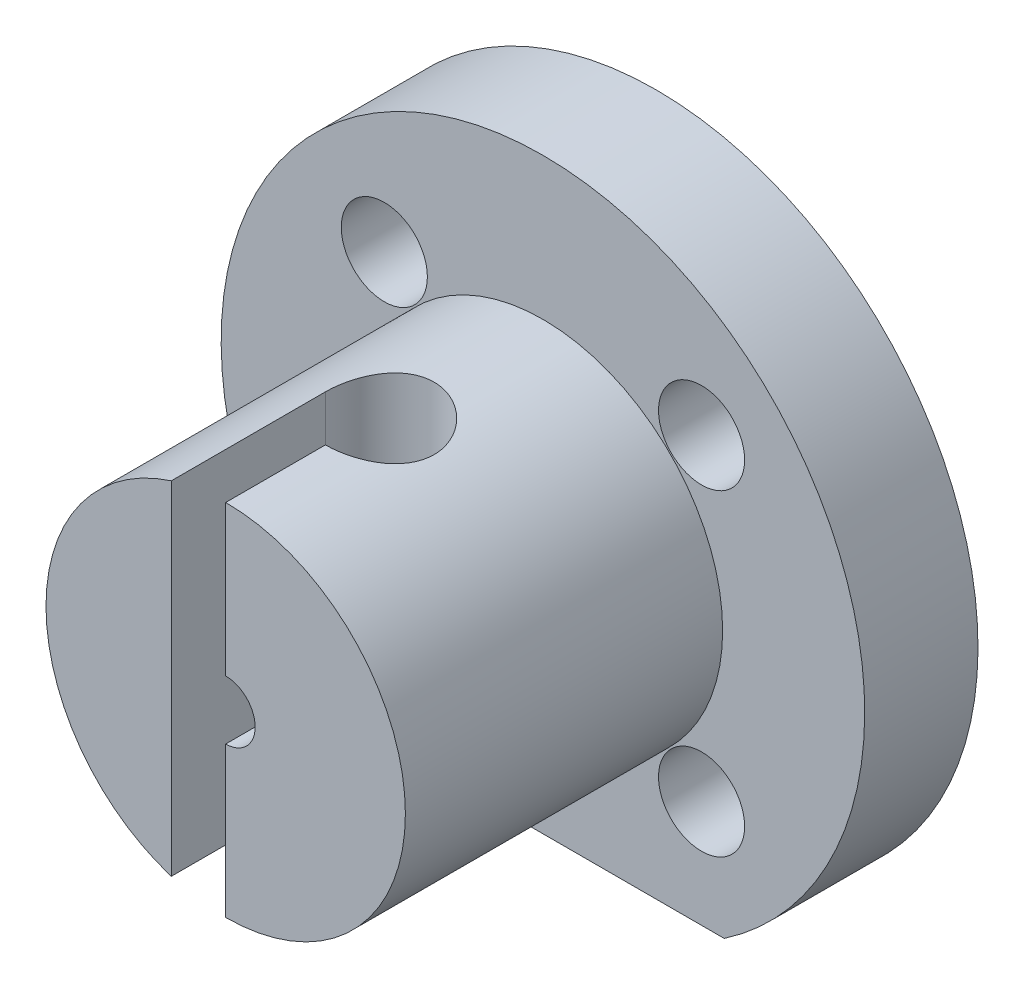
ISO-10303-21;
HEADER;
FILE_DESCRIPTION(('STEP AP214'),'2;1');
FILE_NAME('part.step','',(''),(''),'','','');
FILE_SCHEMA(('AUTOMOTIVE_DESIGN { 1 0 10303 214 1 1 1 1 }'));
ENDSEC;
DATA;
#1=APPLICATION_CONTEXT('core data for automotive mechanical design processes');
#2=APPLICATION_PROTOCOL_DEFINITION('international standard','automotive_design',2000,#1);
#3=PRODUCT_CONTEXT('',#1,'mechanical');
#4=PRODUCT('Part','Part','',(#3));
#5=PRODUCT_RELATED_PRODUCT_CATEGORY('part','',(#4));
#6=PRODUCT_DEFINITION_FORMATION('','',#4);
#7=PRODUCT_DEFINITION_CONTEXT('part definition',#1,'design');
#8=PRODUCT_DEFINITION('design','',#6,#7);
#9=PRODUCT_DEFINITION_SHAPE('','',#8);
#10=(LENGTH_UNIT() NAMED_UNIT(*) SI_UNIT(.MILLI.,.METRE.));
#11=(NAMED_UNIT(*) PLANE_ANGLE_UNIT() SI_UNIT($,.RADIAN.));
#12=(NAMED_UNIT(*) SI_UNIT($,.STERADIAN.) SOLID_ANGLE_UNIT());
#13=UNCERTAINTY_MEASURE_WITH_UNIT(LENGTH_MEASURE(1.E-05),#10,'distance_accuracy_value','');
#14=(GEOMETRIC_REPRESENTATION_CONTEXT(3) GLOBAL_UNCERTAINTY_ASSIGNED_CONTEXT((#13)) GLOBAL_UNIT_ASSIGNED_CONTEXT((#10,
#11,#12)) REPRESENTATION_CONTEXT('',''));
#15=CARTESIAN_POINT('',(0.,0.,0.));
#16=DIRECTION('',(0.,0.,1.));
#17=DIRECTION('',(1.,0.,0.));
#18=AXIS2_PLACEMENT_3D('',#15,#16,#17);
#19=CARTESIAN_POINT('',(0.,0.,5.));
#20=DIRECTION('',(0.,0.,-1.));
#21=DIRECTION('',(-1.,0.,0.));
#22=AXIS2_PLACEMENT_3D('',#19,#20,#21);
#23=CYLINDRICAL_SURFACE('',#22,3.25);
#24=CARTESIAN_POINT('',(-3.25,0.,17.956439749542));
#25=CARTESIAN_POINT('',(-3.24999996693236,0.083563896546241,17.9564398648353));
#26=CARTESIAN_POINT('',(-3.24677096676193,0.167123343293872,17.9543538266574));
#27=CARTESIAN_POINT('',(-3.23391734807946,0.333555171397627,17.9461076212372));
#28=CARTESIAN_POINT('',(-3.22429047825007,0.41642730049974,17.9399460198671));
#29=CARTESIAN_POINT('',(-3.18595574933086,0.663207682517021,17.9156447151389));
#30=CARTESIAN_POINT('',(-3.14779396870059,0.825188308617522,17.891688891228));
#31=CARTESIAN_POINT('',(-3.04855659613359,1.13828809180442,17.831870058011));
#32=CARTESIAN_POINT('',(-2.98762006951948,1.28946666599319,17.7960794630842));
#33=CARTESIAN_POINT('',(-2.84499499316467,1.57943583019607,17.7167568818193));
#34=CARTESIAN_POINT('',(-2.76330258081972,1.71822410791171,17.6732234550176));
#35=CARTESIAN_POINT('',(-2.57212901201941,1.99437802802984,17.5781364963853));
#36=CARTESIAN_POINT('',(-2.46071147687406,2.13027701426631,17.5262149891473));
#37=CARTESIAN_POINT('',(-2.21729460326256,2.38262218284384,17.4231624411781));
#38=CARTESIAN_POINT('',(-2.08528341307837,2.49905708310138,17.3720318743773));
#39=CARTESIAN_POINT('',(-1.79098374604103,2.71867691037722,17.2712659164381));
#40=CARTESIAN_POINT('',(-1.62709552363216,2.81997481240895,17.2221023183224));
#41=CARTESIAN_POINT('',(-1.36809931022023,2.9496044433443,17.1573730310798));
#42=CARTESIAN_POINT('',(-1.27953996702976,2.98910469424918,17.1372938410349));
#43=CARTESIAN_POINT('',(-1.09861795365718,3.06022294831571,17.1007180219324));
#44=CARTESIAN_POINT('',(-1.00625760269819,3.09184567731803,17.0842192457015));
#45=CARTESIAN_POINT('',(-0.826057560643886,3.14455413578487,17.0564941520974));
#46=CARTESIAN_POINT('',(-0.73845451489783,3.16628424100559,17.044949803767));
#47=CARTESIAN_POINT('',(-0.561380566299095,3.20242275220663,17.0256567176893));
#48=CARTESIAN_POINT('',(-0.47191065098631,3.21683493189189,17.0179060237062));
#49=CARTESIAN_POINT('',(-0.291850811820565,3.23813744872504,17.0064241227235));
#50=CARTESIAN_POINT('',(-0.201261326666201,3.245030643204,17.002691388844));
#51=CARTESIAN_POINT('',(-0.0197765201541427,3.25120998258422,16.9993445227305));
#52=CARTESIAN_POINT('',(0.0711187774662691,3.25049670487901,16.9997300778848));
#53=CARTESIAN_POINT('',(0.324584260634256,3.23784378778857,17.0065835083587));
#54=CARTESIAN_POINT('',(0.486706572337187,3.21743259044853,17.0176417439866));
#55=CARTESIAN_POINT('',(0.804703117396463,3.15298819811978,17.0520497508798));
#56=CARTESIAN_POINT('',(0.960576872565473,3.10895319895189,17.0754004609342));
#57=CARTESIAN_POINT('',(1.264141063125,2.99847124841088,17.132626287986));
#58=CARTESIAN_POINT('',(1.41171788658145,2.93177440550806,17.1666184036695));
#59=CARTESIAN_POINT('',(1.69387834199022,2.77832822842747,17.2422094341557));
#60=CARTESIAN_POINT('',(1.82845769113216,2.69157231631065,17.2838108433252));
#61=CARTESIAN_POINT('',(2.0960295127364,2.48999898771934,17.3760568864237));
#62=CARTESIAN_POINT('',(2.22734971450851,2.3731844420122,17.4271926057158));
#63=CARTESIAN_POINT('',(2.46950152361498,2.12009816423318,17.5301814135582));
#64=CARTESIAN_POINT('',(2.58031271060054,1.98380727668562,17.5820351624213));
#65=CARTESIAN_POINT('',(2.78756325494605,1.68172248261859,17.6854910122399));
#66=CARTESIAN_POINT('',(2.8820309516434,1.51441553141212,17.7367108317201));
#67=CARTESIAN_POINT('',(3.00108891492904,1.25110834412701,17.8042753830464));
#68=CARTESIAN_POINT('',(3.03700531506285,1.16126452825694,17.8252555906966));
#69=CARTESIAN_POINT('',(3.1008713993925,0.978003912550656,17.8632716996168));
#70=CARTESIAN_POINT('',(3.12882639782873,0.884589543522835,17.8803102305257));
#71=CARTESIAN_POINT('',(3.17442689107617,0.702564928746536,17.9084703141186));
#72=CARTESIAN_POINT('',(3.19272124708897,0.614173478503267,17.9199578250877));
#73=CARTESIAN_POINT('',(3.22192198879423,0.435756119777968,17.9384273052914));
#74=CARTESIAN_POINT('',(3.23283257877884,0.345731171441865,17.9454118383995));
#75=CARTESIAN_POINT('',(3.24707990238843,0.164890259562273,17.9545518135648));
#76=CARTESIAN_POINT('',(3.25042152893957,0.0740748451557672,17.9567103753403));
#77=CARTESIAN_POINT('',(3.24949268104905,-0.107470356168658,17.9561138418405));
#78=CARTESIAN_POINT('',(3.24522297157071,-0.198200150774714,17.9533592403536));
#79=CARTESIAN_POINT('',(3.22331821945136,-0.443814478138871,17.9393129833951));
#80=CARTESIAN_POINT('',(3.19827229148617,-0.597844457189913,17.9233018347216));
#81=CARTESIAN_POINT('',(3.12702949977269,-0.899004670695931,17.8791221190599));
#82=CARTESIAN_POINT('',(3.08082387501063,-1.04613201932351,17.850948516576));
#83=CARTESIAN_POINT('',(2.96661435840787,-1.33683554250898,17.7842795565511));
#84=CARTESIAN_POINT('',(2.89775284733054,-1.47998175133418,17.7453899190323));
#85=CARTESIAN_POINT('',(2.74089637902852,-1.75353567365312,17.6618939562451));
#86=CARTESIAN_POINT('',(2.652891801511,-1.88393693428162,17.6172847612743));
#87=CARTESIAN_POINT('',(2.44460624673826,-2.14918631391297,17.5192087176446));
#88=CARTESIAN_POINT('',(2.32144841107884,-2.28167102505445,17.4654297186389));
#89=CARTESIAN_POINT('',(2.05415168686647,-2.52500389576817,17.3607560791634));
#90=CARTESIAN_POINT('',(1.91000153159266,-2.63584036131697,17.3098630080996));
#91=CARTESIAN_POINT('',(1.59623133690324,-2.83740347025182,17.2137969098336));
#92=CARTESIAN_POINT('',(1.42574541614468,-2.92697229682576,17.1689940886403));
#93=CARTESIAN_POINT('',(1.06901124460681,-3.07520975573207,17.0931956619618));
#94=CARTESIAN_POINT('',(0.882779216862062,-3.13390975221941,17.0621860469024));
#95=CARTESIAN_POINT('',(0.519984782192657,-3.21295048582072,17.0200700740648));
#96=CARTESIAN_POINT('',(0.344329002045059,-3.23655098662011,17.0072779085069));
#97=CARTESIAN_POINT('',(-0.00888974097188985,-3.25478790029731,16.9974113176913));
#98=CARTESIAN_POINT('',(-0.18645172207702,-3.24943857045981,17.0003291555283));
#99=CARTESIAN_POINT('',(-0.522377048891443,-3.21181360648099,17.0206152423017));
#100=CARTESIAN_POINT('',(-0.681087286049664,-3.1818706796429,17.0367312669691));
#101=CARTESIAN_POINT('',(-0.990865635421161,-3.0994168819248,17.0803156727841));
#102=CARTESIAN_POINT('',(-1.14193280604158,-3.04690323795994,17.107785448861));
#103=CARTESIAN_POINT('',(-1.43837212176543,-2.919004921841,17.1729118126684));
#104=CARTESIAN_POINT('',(-1.58334293721836,-2.842864345024,17.2108997850845));
#105=CARTESIAN_POINT('',(-1.85895274206104,-2.67080961015117,17.2934227450868));
#106=CARTESIAN_POINT('',(-1.9895856970324,-2.57488717497005,17.3379604709756));
#107=CARTESIAN_POINT('',(-2.24842990849123,-2.35355595331007,17.4353107384073));
#108=CARTESIAN_POINT('',(-2.37470791370277,-2.22604211771318,17.4884901031233));
#109=CARTESIAN_POINT('',(-2.60499045889945,-1.95158930176063,17.5935153841537));
#110=CARTESIAN_POINT('',(-2.70896912094435,-1.804628069348,17.645359690449));
#111=CARTESIAN_POINT('',(-2.89761680109323,-1.48418601091211,17.7449166021352));
#112=CARTESIAN_POINT('',(-2.98075058744813,-1.30964241945681,17.7921939070173));
#113=CARTESIAN_POINT('',(-3.08164170237263,-1.03700783985609,17.851699449507));
#114=CARTESIAN_POINT('',(-3.11128882497451,-0.944409041480881,17.869622580199));
#115=CARTESIAN_POINT('',(-3.16229401770445,-0.756225646543187,17.9009024421078));
#116=CARTESIAN_POINT('',(-3.18365747857344,-0.660643035664211,17.9142621423821));
#117=CARTESIAN_POINT('',(-3.21701946053996,-0.471324490371066,17.9353026290082));
#118=CARTESIAN_POINT('',(-3.22936542905966,-0.377673042666827,17.9431934300623));
#119=CARTESIAN_POINT('',(-3.24585577118504,-0.189345835162992,17.9537619591307));
#120=CARTESIAN_POINT('',(-3.25000003746254,-0.0946700619752862,17.9564396189254));
#121=CARTESIAN_POINT('',(-3.25,0.,17.956439749542));
#122=B_SPLINE_CURVE_WITH_KNOTS('',3,(#24,#25,#26,#27,#28,#29,#30,#31,#32,#33,#34,#35,#36,#37,
#38,#39,#40,#41,#42,#43,#44,#45,#46,#47,#48,#49,#50,#51,#52,#53,#54,#55,#56,#57,#58,#59,#60,#61,
#62,#63,#64,#65,#66,#67,#68,#69,#70,#71,#72,#73,#74,#75,#76,#77,#78,#79,#80,#81,#82,#83,#84,#85,
#86,#87,#88,#89,#90,#91,#92,#93,#94,#95,#96,#97,#98,#99,#100,#101,#102,#103,#104,#105,#106,#107,
#108,#109,#110,#111,#112,#113,#114,#115,#116,#117,#118,#119,#120,#121),.UNSPECIFIED.,.T.,.F.,(4,
2,2,2,2,2,2,2,2,2,2,2,2,2,2,2,2,2,2,2,2,2,2,2,2,2,2,2,2,2,2,2,2,2,2,2,2,2,2,2,2,2,2,2,2,2,2,2,
4),(0.,0.250587643905711,0.501263512683478,1.00288609853076,1.50149447113569,2.0001957012224,
2.54767051840409,3.09546157951823,3.68846931388324,3.98518088588187,4.28171402525874,
4.55431788995185,4.82678103525855,5.09914060423011,5.37147949902678,5.86025791897269,
6.34907367285104,6.84346462213203,7.33801792678068,7.8848611780268,8.43224601318052,
9.02532099074312,9.32196328830559,9.61840711036068,9.89098202239147,10.1634016002838,
10.4356450233075,10.7078610865502,11.1761203533233,11.6445736748708,12.1333211529235,
12.6223148194163,13.1860032344655,13.7499953075932,14.3398981640157,14.9292004882003,
15.4593324367861,15.9892033284353,16.4739338801292,16.9587240038499,17.4609819456882,
17.9634504702439,18.5225648363967,19.0823245740261,19.6757109153434,19.9719051953195,
20.2679063967681,20.5517949936652,20.8356873055282),.UNSPECIFIED.);
#123=CARTESIAN_POINT('',(-3.25,0.,17.956439749542));
#124=VERTEX_POINT('',#123);
#125=EDGE_CURVE('E138',#124,#124,#122,.T.);
#126=ORIENTED_EDGE('',*,*,#125,.F.);
#127=EDGE_LOOP('',(#126));
#128=FACE_BOUND('',#127,.T.);
#129=CARTESIAN_POINT('',(0.,0.,-7.5));
#130=DIRECTION('',(0.,0.,-1.));
#131=DIRECTION('',(-1.,0.,0.));
#132=AXIS2_PLACEMENT_3D('',#129,#130,#131);
#133=CIRCLE('',#132,3.25);
#134=CARTESIAN_POINT('',(-3.25,0.,-7.5));
#135=VERTEX_POINT('',#134);
#136=EDGE_CURVE('E119',#135,#135,#133,.T.);
#137=ORIENTED_EDGE('',*,*,#136,.T.);
#138=EDGE_LOOP('',(#137));
#139=FACE_BOUND('',#138,.T.);
#140=ADVANCED_FACE('F33',(#128,#139),#23,.F.);
#141=CARTESIAN_POINT('',(0.,0.,40.));
#142=DIRECTION('',(0.,0.,1.));
#143=DIRECTION('',(1.,0.,0.));
#144=AXIS2_PLACEMENT_3D('',#141,#142,#143);
#145=PLANE('',#144);
#146=DIRECTION('',(0.,1.,0.));
#147=VECTOR('',#146,1.);
#148=CARTESIAN_POINT('',(-6.,-35.5,40.));
#149=LINE('',#148,#147);
#150=CARTESIAN_POINT('',(-6.,-18.8952540337514,40.));
#151=VERTEX_POINT('',#150);
#152=CARTESIAN_POINT('',(-6.,18.8952540337514,40.));
#153=VERTEX_POINT('',#152);
#154=EDGE_CURVE('E126',#151,#153,#149,.T.);
#155=ORIENTED_EDGE('',*,*,#154,.T.);
#156=CARTESIAN_POINT('',(0.,0.,40.));
#157=DIRECTION('',(0.,0.,1.));
#158=DIRECTION('',(1.,0.,0.));
#159=AXIS2_PLACEMENT_3D('',#156,#157,#158);
#160=CIRCLE('',#159,19.825);
#161=EDGE_CURVE('E267',#153,#151,#160,.T.);
#162=ORIENTED_EDGE('',*,*,#161,.T.);
#163=EDGE_LOOP('',(#155,#162));
#164=FACE_BOUND('',#163,.T.);
#165=ADVANCED_FACE('F191',(#164),#145,.T.);
#166=CARTESIAN_POINT('',(0.,0.,5.));
#167=DIRECTION('',(0.,0.,1.));
#168=DIRECTION('',(1.,0.,0.));
#169=AXIS2_PLACEMENT_3D('',#166,#167,#168);
#170=PLANE('',#169);
#171=CARTESIAN_POINT('',(-17.500892834367,17.5008928343671,5.));
#172=DIRECTION('',(0.,0.,1.));
#173=DIRECTION('',(1.,0.,0.));
#174=AXIS2_PLACEMENT_3D('',#171,#172,#173);
#175=CIRCLE('',#174,4.75);
#176=CARTESIAN_POINT('',(-12.750892834367,17.5008928343671,5.));
#177=VERTEX_POINT('',#176);
#178=EDGE_CURVE('E258',#177,#177,#175,.F.);
#179=ORIENTED_EDGE('',*,*,#178,.T.);
#180=EDGE_LOOP('',(#179));
#181=FACE_BOUND('',#180,.T.);
#182=CARTESIAN_POINT('',(17.5008928343671,17.500892834367,5.));
#183=DIRECTION('',(0.,0.,1.));
#184=DIRECTION('',(1.,0.,0.));
#185=AXIS2_PLACEMENT_3D('',#182,#183,#184);
#186=CIRCLE('',#185,4.75);
#187=CARTESIAN_POINT('',(22.2508928343671,17.500892834367,5.));
#188=VERTEX_POINT('',#187);
#189=EDGE_CURVE('E252',#188,#188,#186,.F.);
#190=ORIENTED_EDGE('',*,*,#189,.T.);
#191=EDGE_LOOP('',(#190));
#192=FACE_BOUND('',#191,.T.);
#193=CARTESIAN_POINT('',(17.500892834367,-17.5008928343671,5.));
#194=DIRECTION('',(0.,0.,1.));
#195=DIRECTION('',(1.,0.,0.));
#196=AXIS2_PLACEMENT_3D('',#193,#194,#195);
#197=CIRCLE('',#196,4.75);
#198=CARTESIAN_POINT('',(22.250892834367,-17.5008928343671,5.));
#199=VERTEX_POINT('',#198);
#200=EDGE_CURVE('E238',#199,#199,#197,.F.);
#201=ORIENTED_EDGE('',*,*,#200,.T.);
#202=EDGE_LOOP('',(#201));
#203=FACE_BOUND('',#202,.T.);
#204=CARTESIAN_POINT('',(-17.5008928343671,-17.500892834367,5.));
#205=DIRECTION('',(0.,0.,1.));
#206=DIRECTION('',(1.,0.,0.));
#207=AXIS2_PLACEMENT_3D('',#204,#205,#206);
#208=CIRCLE('',#207,4.75);
#209=CARTESIAN_POINT('',(-12.7508928343671,-17.500892834367,5.));
#210=VERTEX_POINT('',#209);
#211=EDGE_CURVE('E243',#210,#210,#208,.F.);
#212=ORIENTED_EDGE('',*,*,#211,.T.);
#213=EDGE_LOOP('',(#212));
#214=FACE_BOUND('',#213,.T.);
#215=DIRECTION('',(-1.,0.,0.));
#216=VECTOR('',#215,1.);
#217=CARTESIAN_POINT('',(-20.,-29.3300187521249,5.));
#218=LINE('',#217,#216);
#219=CARTESIAN_POINT('',(20.,-29.3300187521249,5.));
#220=VERTEX_POINT('',#219);
#221=CARTESIAN_POINT('',(-20.,-29.3300187521249,5.));
#222=VERTEX_POINT('',#221);
#223=EDGE_CURVE('E109',#220,#222,#218,.T.);
#224=ORIENTED_EDGE('',*,*,#223,.F.);
#225=CARTESIAN_POINT('',(0.,0.,5.));
#226=DIRECTION('',(0.,0.,1.));
#227=DIRECTION('',(1.,0.,0.));
#228=AXIS2_PLACEMENT_3D('',#225,#226,#227);
#229=CIRCLE('',#228,35.5);
#230=EDGE_CURVE('E105',#220,#222,#229,.T.);
#231=ORIENTED_EDGE('',*,*,#230,.T.);
#232=EDGE_LOOP('',(#224,#231));
#233=FACE_BOUND('',#232,.T.);
#234=CARTESIAN_POINT('',(0.,0.,5.));
#235=DIRECTION('',(0.,0.,1.));
#236=DIRECTION('',(1.,0.,0.));
#237=AXIS2_PLACEMENT_3D('',#234,#235,#236);
#238=CIRCLE('',#237,19.825);
#239=CARTESIAN_POINT('',(19.825,0.,5.));
#240=VERTEX_POINT('',#239);
#241=EDGE_CURVE('E273',#240,#240,#238,.T.);
#242=ORIENTED_EDGE('',*,*,#241,.F.);
#243=EDGE_LOOP('',(#242));
#244=FACE_BOUND('',#243,.T.);
#245=ADVANCED_FACE('F198',(#181,#192,#203,#214,#233,#244),#170,.T.);
#246=CARTESIAN_POINT('',(0.,0.,5.));
#247=DIRECTION('',(0.,0.,-1.));
#248=DIRECTION('',(-1.,0.,0.));
#249=AXIS2_PLACEMENT_3D('',#246,#247,#248);
#250=CYLINDRICAL_SURFACE('',#249,35.5);
#251=DIRECTION('',(0.,0.,1.));
#252=VECTOR('',#251,1.);
#253=CARTESIAN_POINT('',(20.,-29.3300187521249,-2.5));
#254=LINE('',#253,#252);
#255=CARTESIAN_POINT('',(20.,-29.3300187521249,-7.5));
#256=VERTEX_POINT('',#255);
#257=EDGE_CURVE('E99',#256,#220,#254,.T.);
#258=ORIENTED_EDGE('',*,*,#257,.F.);
#259=CARTESIAN_POINT('',(0.,0.,-7.5));
#260=DIRECTION('',(0.,0.,-1.));
#261=DIRECTION('',(-1.,0.,0.));
#262=AXIS2_PLACEMENT_3D('',#259,#260,#261);
#263=CIRCLE('',#262,35.5);
#264=CARTESIAN_POINT('',(-20.,-29.3300187521249,-7.5));
#265=VERTEX_POINT('',#264);
#266=EDGE_CURVE('E103',#265,#256,#263,.T.);
#267=ORIENTED_EDGE('',*,*,#266,.F.);
#268=DIRECTION('',(0.,0.,1.));
#269=VECTOR('',#268,1.);
#270=CARTESIAN_POINT('',(-20.,-29.3300187521249,-2.5));
#271=LINE('',#270,#269);
#272=EDGE_CURVE('E108',#265,#222,#271,.T.);
#273=ORIENTED_EDGE('',*,*,#272,.T.);
#274=ORIENTED_EDGE('',*,*,#230,.F.);
#275=EDGE_LOOP('',(#258,#267,#273,#274));
#276=FACE_BOUND('',#275,.T.);
#277=ADVANCED_FACE('F35',(#276),#250,.T.);
#278=DIRECTION('',(0.,0.,-1.));
#279=VECTOR('',#278,1.);
#280=CARTESIAN_POINT('',(0.,-3.25,5.));
#281=LINE('',#280,#279);
#282=CARTESIAN_POINT('',(0.,-3.25,40.));
#283=VERTEX_POINT('',#282);
#284=CARTESIAN_POINT('',(0.,-3.25,29.));
#285=VERTEX_POINT('',#284);
#286=EDGE_CURVE('E136',#283,#285,#281,.T.);
#287=ORIENTED_EDGE('',*,*,#286,.F.);
#288=CARTESIAN_POINT('',(0.,0.,40.));
#289=DIRECTION('',(0.,0.,1.));
#290=DIRECTION('',(1.,0.,0.));
#291=AXIS2_PLACEMENT_3D('',#288,#289,#290);
#292=CIRCLE('',#291,3.25);
#293=CARTESIAN_POINT('',(0.,3.25,40.));
#294=VERTEX_POINT('',#293);
#295=EDGE_CURVE('E275',#283,#294,#292,.T.);
#296=ORIENTED_EDGE('',*,*,#295,.T.);
#297=DIRECTION('',(0.,0.,-1.));
#298=VECTOR('',#297,1.);
#299=CARTESIAN_POINT('',(0.,3.25,5.));
#300=LINE('',#299,#298);
#301=CARTESIAN_POINT('',(0.,3.25,29.));
#302=VERTEX_POINT('',#301);
#303=EDGE_CURVE('E128',#302,#294,#300,.F.);
#304=ORIENTED_EDGE('',*,*,#303,.F.);
#305=CARTESIAN_POINT('',(0.,-3.25,29.));
#306=CARTESIAN_POINT('',(0.0848991252216906,-3.25001438396097,29.0000159480564));
#307=CARTESIAN_POINT('',(0.169787846887066,-3.24667372117215,28.9981984707038));
#308=CARTESIAN_POINT('',(0.338859775495451,-3.23339399603572,28.9910165846171));
#309=CARTESIAN_POINT('',(0.423043279706292,-3.22345787193552,28.9856537553251));
#310=CARTESIAN_POINT('',(0.589684261506273,-3.19716383165988,28.9715358390958));
#311=CARTESIAN_POINT('',(0.672148210509449,-3.18083787595079,28.9627976377908));
#312=CARTESIAN_POINT('',(0.835176775979974,-3.1419756897406,28.9421581112697));
#313=CARTESIAN_POINT('',(0.91574125727987,-3.11943901871993,28.9302565616827));
#314=CARTESIAN_POINT('',(1.15355019653916,-3.04293645243072,28.8902496897388));
#315=CARTESIAN_POINT('',(1.30729379567914,-2.98001621786547,28.8578077178377));
#316=CARTESIAN_POINT('',(1.60182850471192,-2.8326430389476,28.7842285156031));
#317=CARTESIAN_POINT('',(1.74260525374315,-2.74816660211553,28.7430818070504));
#318=CARTESIAN_POINT('',(2.01774528208115,-2.55370853262424,28.65252475036));
#319=CARTESIAN_POINT('',(2.15104858327724,-2.44239820512781,28.6027456280026));
#320=CARTESIAN_POINT('',(2.39807210307004,-2.20039202128241,28.5015553875448));
#321=CARTESIAN_POINT('',(2.51177659104564,-2.06968074827885,28.4501429973658));
#322=CARTESIAN_POINT('',(2.72734796575925,-1.7776338726572,28.3457677980499));
#323=CARTESIAN_POINT('',(2.82706767822079,-1.61456924958507,28.2931208162424));
#324=CARTESIAN_POINT('',(2.95466305080698,-1.35708155360397,28.2222931260449));
#325=CARTESIAN_POINT('',(2.9935395869762,-1.26907411037419,28.2000353000966));
#326=CARTESIAN_POINT('',(3.06354791902594,-1.08924965132927,28.1591003274543));
#327=CARTESIAN_POINT('',(3.09468464648891,-0.997435105036177,28.1404209024558));
#328=CARTESIAN_POINT('',(3.14709082792702,-0.816476481226408,28.108493306667));
#329=CARTESIAN_POINT('',(3.16885405628465,-0.727522237051331,28.0949793239977));
#330=CARTESIAN_POINT('',(3.20484898437346,-0.547589348111354,28.0724151090334));
#331=CARTESIAN_POINT('',(3.21908504371074,-0.456611907037711,28.0633622931148));
#332=CARTESIAN_POINT('',(3.23978060227373,-0.273493964034708,28.0501462256532));
#333=CARTESIAN_POINT('',(3.24624682557466,-0.181354537587818,28.045978746379));
#334=CARTESIAN_POINT('',(3.25131118125863,0.00319746009616717,28.0427149233096));
#335=CARTESIAN_POINT('',(3.24991032645244,0.0956099946422421,28.0436179267383));
#336=CARTESIAN_POINT('',(3.2354714888185,0.344843437064875,28.0529112338617));
#337=CARTESIAN_POINT('',(3.21492395502097,0.501129750787169,28.0661323208845));
#338=CARTESIAN_POINT('',(3.15199314153298,0.807444567559779,28.1055129069444));
#339=CARTESIAN_POINT('',(3.10960101004834,0.957470507142058,28.1316776507947));
#340=CARTESIAN_POINT('',(3.00359792428456,1.25133242979149,28.1944445456706));
#341=CARTESIAN_POINT('',(2.93953964710149,1.39495894226624,28.2312641484783));
#342=CARTESIAN_POINT('',(2.79239484521996,1.67015557613338,28.3112652904128));
#343=CARTESIAN_POINT('',(2.70929940161819,1.80172000586518,28.3544498081063));
#344=CARTESIAN_POINT('',(2.51173341701824,2.07014867487807,28.4502273555618));
#345=CARTESIAN_POINT('',(2.39441221833104,2.20477038637111,28.5032518381469));
#346=CARTESIAN_POINT('',(2.13890382051035,2.45345306897113,28.607510770687));
#347=CARTESIAN_POINT('',(2.00070205114584,2.56749956002751,28.6587439396993));
#348=CARTESIAN_POINT('',(1.69619683393407,2.77881281423961,28.757604879287));
#349=CARTESIAN_POINT('',(1.52866331684749,2.87454563667608,28.8047943510625));
#350=CARTESIAN_POINT('',(1.26502276000958,2.9952598230921,28.8658250268314));
#351=CARTESIAN_POINT('',(1.17511887279802,3.03167512365904,28.8845382397206));
#352=CARTESIAN_POINT('',(0.991800717712359,3.09649421893089,28.9181927787231));
#353=CARTESIAN_POINT('',(0.898387512866368,3.12490041789551,28.9331352366412));
#354=CARTESIAN_POINT('',(0.673312585252027,3.18232371187741,28.9635453209622));
#355=CARTESIAN_POINT('',(0.54040018329179,3.20760377125732,28.9771233130003));
#356=CARTESIAN_POINT('',(0.338977885177679,3.23298705853471,28.9907981386006));
#357=CARTESIAN_POINT('',(0.27141042877766,3.2393587762576,28.994241152272));
#358=CARTESIAN_POINT('',(0.135904435324297,3.24786671700521,28.9988441307128));
#359=CARTESIAN_POINT('',(0.0679657576310121,3.25000120435423,29.0000031599035));
#360=CARTESIAN_POINT('',(0.,3.25,29.));
#361=B_SPLINE_CURVE_WITH_KNOTS('',3,(#305,#306,#307,#308,#309,#310,#311,#312,#313,#314,#315,
#316,#317,#318,#319,#320,#321,#322,#323,#324,#325,#326,#327,#328,#329,#330,#331,#332,#333,#334,
#335,#336,#337,#338,#339,#340,#341,#342,#343,#344,#345,#346,#347,#348,#349,#350,#351,#352,#353,
#354,#355,#356,#357,#358,#359,#360),.UNSPECIFIED.,.F.,.F.,(4,2,2,2,2,2,2,2,2,2,2,2,2,2,2,2,2,2,
2,2,2,2,2,2,2,2,2,4),(0.,0.254595003403073,0.509076661967326,0.762301402199473,1.01554410802382,
1.52087402605827,2.02675703483637,2.56650074718851,3.10667567760821,3.69810936447548,
3.99401265950658,4.28972692741693,4.56702343531624,4.84415916145781,5.12105487910148,
5.3979149498968,5.87000823875002,6.34229297826225,6.82499303690956,7.30791970444089,
7.86436851288098,8.42120741388194,9.01355796762991,9.30952989890421,9.60541288726083,
10.0118437238039,10.2155610891216,10.4193618849701),.UNSPECIFIED.);
#362=EDGE_CURVE('E146',#285,#302,#361,.T.);
#363=ORIENTED_EDGE('',*,*,#362,.F.);
#364=EDGE_LOOP('',(#287,#296,#304,#363));
#365=FACE_BOUND('',#364,.T.);
#366=ADVANCED_FACE('F152',(#365),#23,.F.);
#367=DIRECTION('',(0.,1.,0.));
#368=VECTOR('',#367,1.);
#369=CARTESIAN_POINT('',(0.,-35.5,40.));
#370=LINE('',#369,#368);
#371=CARTESIAN_POINT('',(0.,-19.825,40.));
#372=VERTEX_POINT('',#371);
#373=EDGE_CURVE('E121',#372,#283,#370,.T.);
#374=ORIENTED_EDGE('',*,*,#373,.F.);
#375=CARTESIAN_POINT('',(0.,19.825,40.));
#376=VERTEX_POINT('',#375);
#377=EDGE_CURVE('E270',#372,#376,#160,.T.);
#378=ORIENTED_EDGE('',*,*,#377,.T.);
#379=EDGE_CURVE('E48',#294,#376,#370,.T.);
#380=ORIENTED_EDGE('',*,*,#379,.F.);
#381=ORIENTED_EDGE('',*,*,#295,.F.);
#382=EDGE_LOOP('',(#374,#378,#380,#381));
#383=FACE_BOUND('',#382,.T.);
#384=ADVANCED_FACE('F186',(#383),#145,.T.);
#385=CARTESIAN_POINT('',(0.,0.,40.));
#386=DIRECTION('',(0.,0.,-1.));
#387=DIRECTION('',(-1.,0.,0.));
#388=AXIS2_PLACEMENT_3D('',#385,#386,#387);
#389=CYLINDRICAL_SURFACE('',#388,19.825);
#390=CARTESIAN_POINT('',(0.,-19.825,29.));
#391=CARTESIAN_POINT('',(0.164769457220433,-19.8250200501844,29.0000219965372));
#392=CARTESIAN_POINT('',(0.329531226532251,-19.8229465723247,28.9932137486893));
#393=CARTESIAN_POINT('',(0.657807143189877,-19.8147584953363,28.9660990649072));
#394=CARTESIAN_POINT('',(0.821321534332901,-19.8086447074678,28.9457953387467));
#395=CARTESIAN_POINT('',(1.14554838440966,-19.792541166044,28.8919165508894));
#396=CARTESIAN_POINT('',(1.3062666216154,-19.7825607412674,28.858373427379));
#397=CARTESIAN_POINT('',(1.62416964930215,-19.7590002201101,28.7783161045273));
#398=CARTESIAN_POINT('',(1.78135436860396,-19.7454200512866,28.7318016441439));
#399=CARTESIAN_POINT('',(2.09103839468161,-19.7150294429296,28.6262164175891));
#400=CARTESIAN_POINT('',(2.24353989897877,-19.6982205461407,28.567151646757));
#401=CARTESIAN_POINT('',(2.54299169711294,-19.6618050545203,28.4368983024127));
#402=CARTESIAN_POINT('',(2.68993990454297,-19.6421974211469,28.36570522648));
#403=CARTESIAN_POINT('',(2.97729856536343,-19.6006988548055,28.2117428648698));
#404=CARTESIAN_POINT('',(3.11770907359393,-19.5788079409952,28.1289736763193));
#405=CARTESIAN_POINT('',(3.39119128777856,-19.5332965292532,27.9524059956559));
#406=CARTESIAN_POINT('',(3.52426019359003,-19.509675379283,27.8586033374355));
#407=CARTESIAN_POINT('',(3.78553861179264,-19.4606896811231,27.6580588368178));
#408=CARTESIAN_POINT('',(3.91353464041267,-19.4352958972701,27.551045923437));
#409=CARTESIAN_POINT('',(4.16016476714837,-19.3840018537468,27.3267566132495));
#410=CARTESIAN_POINT('',(4.27879559413015,-19.3581014210181,27.2094766602101));
#411=CARTESIAN_POINT('',(4.50591220546873,-19.3065000757693,26.9654183774354));
#412=CARTESIAN_POINT('',(4.61439738041838,-19.280799175319,26.8386394779606));
#413=CARTESIAN_POINT('',(4.82051309269783,-19.2303026573629,26.5763766625668));
#414=CARTESIAN_POINT('',(4.9181436846866,-19.2055070352989,26.4408927904877));
#415=CARTESIAN_POINT('',(5.10402273752518,-19.1569575001888,26.1588189550555));
#416=CARTESIAN_POINT('',(5.19200095244385,-19.1332411057984,26.0120442422088));
#417=CARTESIAN_POINT('',(5.35520303395347,-19.0882055972137,25.7112841664934));
#418=CARTESIAN_POINT('',(5.43043162230093,-19.0668855965173,25.5573015001332));
#419=CARTESIAN_POINT('',(5.56757313644045,-19.0272923225314,25.2431038293202));
#420=CARTESIAN_POINT('',(5.62948392442621,-19.0090195384943,25.0828878291442));
#421=CARTESIAN_POINT('',(5.73940722352415,-18.9761198461244,24.7574655496211));
#422=CARTESIAN_POINT('',(5.78742581744878,-18.961491342504,24.5922614894378));
#423=CARTESIAN_POINT('',(5.8680041016005,-18.9367072264921,24.2627300393278));
#424=CARTESIAN_POINT('',(5.90095950195279,-18.926437696718,24.0985079556915));
#425=CARTESIAN_POINT('',(5.95303201914685,-18.9101237884647,23.7677409622678));
#426=CARTESIAN_POINT('',(5.97215472950005,-18.9040777021898,23.601197019168));
#427=CARTESIAN_POINT('',(5.99639774395603,-18.8964018144794,23.2669917219053));
#428=CARTESIAN_POINT('',(6.00151809158479,-18.894771999316,23.0993303712176));
#429=CARTESIAN_POINT('',(5.997705722899,-18.8959825294408,22.7641857469821));
#430=CARTESIAN_POINT('',(5.98877331638654,-18.8988227761836,22.59670246959));
#431=CARTESIAN_POINT('',(5.95753512070651,-18.9086925541187,22.2693870313864));
#432=CARTESIAN_POINT('',(5.93573705581994,-18.9155629801175,22.1095012942702));
#433=CARTESIAN_POINT('',(5.8793785285214,-18.9331562020795,21.7921556137538));
#434=CARTESIAN_POINT('',(5.84481373432342,-18.9438803055726,21.6346965126303));
#435=CARTESIAN_POINT('',(5.76323066821839,-18.9688590461368,21.3233789072986));
#436=CARTESIAN_POINT('',(5.71621612514512,-18.983112626009,21.1695193399836));
#437=CARTESIAN_POINT('',(5.61009319095667,-19.0147454357042,20.8663013901878));
#438=CARTESIAN_POINT('',(5.55098021626698,-19.0321258498474,20.7169447383453));
#439=CARTESIAN_POINT('',(5.42023568217244,-19.0697759716651,20.4217358815169));
#440=CARTESIAN_POINT('',(5.34844587707326,-19.0900815212411,20.2759582193317));
#441=CARTESIAN_POINT('',(5.19343753108553,-19.1328329962624,19.9909192252194));
#442=CARTESIAN_POINT('',(5.11021482712474,-19.1552797004541,19.8516602918423));
#443=CARTESIAN_POINT('',(4.84423816957292,-19.2249201611346,19.444990029862));
#444=CARTESIAN_POINT('',(4.64507347271605,-19.2744450412492,19.1884554753006));
#445=CARTESIAN_POINT('',(4.19894254162159,-19.3766346688083,18.7008367580669));
#446=CARTESIAN_POINT('',(3.95030320286605,-19.4293433618354,18.4712995634515));
#447=CARTESIAN_POINT('',(3.41737638186693,-19.5301201551247,18.0567789035011));
#448=CARTESIAN_POINT('',(3.13308657370244,-19.5781879522414,17.8717983474485));
#449=CARTESIAN_POINT('',(2.53412174049401,-19.6647127131213,17.550737156977));
#450=CARTESIAN_POINT('',(2.21925005776612,-19.7031008659488,17.4150037789608));
#451=CARTESIAN_POINT('',(1.56971355793087,-19.7654467998418,17.1988750742637));
#452=CARTESIAN_POINT('',(1.23505441600238,-19.7894086966206,17.1184639635788));
#453=CARTESIAN_POINT('',(0.568538209666622,-19.8195512121312,17.0178431653382));
#454=CARTESIAN_POINT('',(0.237023676209461,-19.8263481506065,16.9955458754406));
#455=CARTESIAN_POINT('',(-0.425035668132232,-19.8232060903095,17.0059270691149));
#456=CARTESIAN_POINT('',(-0.755580603847832,-19.8132693500116,17.0385981338384));
#457=CARTESIAN_POINT('',(-1.39839775539448,-19.7781808373591,17.156299890178));
#458=CARTESIAN_POINT('',(-1.71091556322205,-19.7533851809416,17.2401058872744));
#459=CARTESIAN_POINT('',(-2.31739202828299,-19.6914527319955,17.4562337342344));
#460=CARTESIAN_POINT('',(-2.61134827119511,-19.6543143379533,17.5885618802471));
#461=CARTESIAN_POINT('',(-3.17997398454512,-19.5704627252333,17.9014121179984));
#462=CARTESIAN_POINT('',(-3.45402989628601,-19.5235454854912,18.082991128788));
#463=CARTESIAN_POINT('',(-3.96856914071462,-19.4254920325821,18.4880628272019));
#464=CARTESIAN_POINT('',(-4.20904653473829,-19.374355075658,18.7115629126095));
#465=CARTESIAN_POINT('',(-4.54408339475152,-19.2975590947889,19.0782419158685));
#466=CARTESIAN_POINT('',(-4.65318881444012,-19.2714772485235,19.2083406263723));
#467=CARTESIAN_POINT('',(-4.86006529657718,-19.2203465097287,19.4774269293962));
#468=CARTESIAN_POINT('',(-4.95784041266917,-19.19529724985,19.6164113151009));
#469=CARTESIAN_POINT('',(-5.14144452496397,-19.1469372156967,19.9025051498011));
#470=CARTESIAN_POINT('',(-5.22726338940208,-19.1236279235466,20.0496213440492));
#471=CARTESIAN_POINT('',(-5.38618556950077,-19.0794766780391,20.3508517824997));
#472=CARTESIAN_POINT('',(-5.45929413429156,-19.0586337072757,20.5049631045184));
#473=CARTESIAN_POINT('',(-5.59202094393909,-19.0201127934075,20.8186670050929));
#474=CARTESIAN_POINT('',(-5.65168289483202,-19.0024246363844,20.9782398251565));
#475=CARTESIAN_POINT('',(-5.75728213255144,-18.9706976609378,21.302147693264));
#476=CARTESIAN_POINT('',(-5.80322533604415,-18.9566572696345,21.4664806546947));
#477=CARTESIAN_POINT('',(-5.88092274075638,-18.9326972210258,21.798435471252));
#478=CARTESIAN_POINT('',(-5.91270296895697,-18.9227700074067,21.9660506976802));
#479=CARTESIAN_POINT('',(-5.9618726813175,-18.907336430777,22.3035004703899));
#480=CARTESIAN_POINT('',(-5.97927183506665,-18.9018270973337,22.4733334473196));
#481=CARTESIAN_POINT('',(-5.99293762322441,-18.8974953353944,22.7029454723475));
#482=CARTESIAN_POINT('',(-5.99558728139716,-18.8966547422545,22.7623602064804));
#483=CARTESIAN_POINT('',(-5.99911726076058,-18.895534437107,22.8811808797883));
#484=CARTESIAN_POINT('',(-5.99999956055308,-18.895254097882,22.9405867542649));
#485=CARTESIAN_POINT('',(-6.,-18.8952540337515,23.));
#486=B_SPLINE_CURVE_WITH_KNOTS('',3,(#390,#391,#392,#393,#394,#395,#396,#397,#398,#399,#400,
#401,#402,#403,#404,#405,#406,#407,#408,#409,#410,#411,#412,#413,#414,#415,#416,#417,#418,#419,
#420,#421,#422,#423,#424,#425,#426,#427,#428,#429,#430,#431,#432,#433,#434,#435,#436,#437,#438,
#439,#440,#441,#442,#443,#444,#445,#446,#447,#448,#449,#450,#451,#452,#453,#454,#455,#456,#457,
#458,#459,#460,#461,#462,#463,#464,#465,#466,#467,#468,#469,#470,#471,#472,#473,#474,#475,#476,
#477,#478,#479,#480,#481,#482,#483,#484,#485),.UNSPECIFIED.,.F.,.F.,(4,2,2,2,2,2,2,2,2,2,2,2,2,
2,2,2,2,2,2,2,2,2,2,2,2,2,2,2,2,2,2,2,2,2,2,2,2,2,2,2,2,2,2,2,2,2,2,4),(0.,0.494142939547623,
0.988186689478926,1.48104584188957,1.97391491357778,2.46654906671705,2.9593665017578,
3.45217980216109,3.94517978401073,4.45087962430284,4.95675532406766,5.46266139019362,
5.96856490868026,6.486206545113,7.00365605480058,7.52118856488426,8.03849412490985,
8.5412945714989,9.04389158732917,9.54648704084714,10.0490714144771,10.5330357920234,
11.0171645310757,11.5011484320447,11.9853160342136,12.4760207031321,12.9669045287676,
13.9479210265282,14.9706714231826,15.9934885812403,17.0233838505241,18.0529851582528,
19.0450557007267,20.0369923583386,21.006056646354,21.9752467229784,22.9671536569632,
23.959235797049,24.4740860235324,24.9887514795769,25.5038504459623,26.0187361775879,
26.5319234143684,27.0448890013393,27.5569079961597,28.0685824374306,28.247000091871,
28.4252178914085),.UNSPECIFIED.);
#487=CARTESIAN_POINT('',(0.,-19.825,29.));
#488=VERTEX_POINT('',#487);
#489=CARTESIAN_POINT('',(-6.,-18.8952540337514,23.));
#490=VERTEX_POINT('',#489);
#491=EDGE_CURVE('E41',#488,#490,#486,.T.);
#492=ORIENTED_EDGE('',*,*,#491,.T.);
#493=DIRECTION('',(0.,0.,-1.));
#494=VECTOR('',#493,1.);
#495=CARTESIAN_POINT('',(-6.,-18.8952540337514,40.));
#496=LINE('',#495,#494);
#497=EDGE_CURVE('E11',#490,#151,#496,.F.);
#498=ORIENTED_EDGE('',*,*,#497,.T.);
#499=ORIENTED_EDGE('',*,*,#161,.F.);
#500=DIRECTION('',(0.,0.,-1.));
#501=VECTOR('',#500,1.);
#502=CARTESIAN_POINT('',(-6.,18.8952540337514,40.));
#503=LINE('',#502,#501);
#504=CARTESIAN_POINT('',(-6.,18.8952540337514,23.));
#505=VERTEX_POINT('',#504);
#506=EDGE_CURVE('E56',#153,#505,#503,.T.);
#507=ORIENTED_EDGE('',*,*,#506,.T.);
#508=CARTESIAN_POINT('',(-6.,18.8952540337514,23.));
#509=CARTESIAN_POINT('',(-6.00002237964286,18.8952301483911,22.835405403029));
#510=CARTESIAN_POINT('',(-5.99322817453371,18.8974038803828,22.6708195228013));
#511=CARTESIAN_POINT('',(-5.96617238031654,18.905972138425,22.3429054631847));
#512=CARTESIAN_POINT('',(-5.94591386423565,18.91236570136,22.1795770054107));
#513=CARTESIAN_POINT('',(-5.89216402579116,18.9291777677103,21.855757134688));
#514=CARTESIAN_POINT('',(-5.85870673355483,18.9395859188732,21.6952595260874));
#515=CARTESIAN_POINT('',(-5.77886291361255,18.9641008771017,21.3778013376834));
#516=CARTESIAN_POINT('',(-5.73247603821611,18.9782077836303,21.2208408531197));
#517=CARTESIAN_POINT('',(-5.62719596121642,19.0096896585082,20.9116209024703));
#518=CARTESIAN_POINT('',(-5.56831034458485,19.0270626440811,20.7593586491217));
#519=CARTESIAN_POINT('',(-5.43845906321055,19.0645837787985,20.4603665462376));
#520=CARTESIAN_POINT('',(-5.36748890334891,19.0847329600776,20.3136387802784));
#521=CARTESIAN_POINT('',(-5.21400298390136,19.1272354456406,20.0266766489808));
#522=CARTESIAN_POINT('',(-5.1314864499209,19.1495888977312,19.8864427200127));
#523=CARTESIAN_POINT('',(-4.95544797529739,19.1958965458239,19.6132685243915));
#524=CARTESIAN_POINT('',(-4.86192187286099,19.2198513456728,19.4803310439359));
#525=CARTESIAN_POINT('',(-4.66166223312664,19.2694179910869,19.2188904100103));
#526=CARTESIAN_POINT('',(-4.55462699081708,19.2950576512821,19.0906235414669));
#527=CARTESIAN_POINT('',(-4.33023571738162,19.3466518690972,18.8434472088777));
#528=CARTESIAN_POINT('',(-4.21287610573912,19.3726065332496,18.7245410184429));
#529=CARTESIAN_POINT('',(-3.96860467352858,19.4241184870283,18.4968843671443));
#530=CARTESIAN_POINT('',(-3.84169279253121,19.4496757741394,18.3881339705376));
#531=CARTESIAN_POINT('',(-3.57910771916026,19.4997044490104,18.1815044369419));
#532=CARTESIAN_POINT('',(-3.44343459674062,19.5241758454379,18.0836252131691));
#533=CARTESIAN_POINT('',(-3.16118948621108,19.5718782986819,17.8974450342409));
#534=CARTESIAN_POINT('',(-3.01444667708199,19.5950717316733,17.8093931181967));
#535=CARTESIAN_POINT('',(-2.71374059556297,19.6389743326354,17.6460409555043));
#536=CARTESIAN_POINT('',(-2.55978002293422,19.6596844193359,17.5707359887711));
#537=CARTESIAN_POINT('',(-2.24562483626169,19.6980414319603,17.4334427985633));
#538=CARTESIAN_POINT('',(-2.08542907907965,19.7156877929216,17.3714570306995));
#539=CARTESIAN_POINT('',(-1.76005795913636,19.7473927944947,17.2613872368242));
#540=CARTESIAN_POINT('',(-1.59488478862976,19.7614529895037,17.2132971866106));
#541=CARTESIAN_POINT('',(-1.26553756149358,19.7852346973535,17.1326044668278));
#542=CARTESIAN_POINT('',(-1.10147076651996,19.7950691011218,17.0995970937372));
#543=CARTESIAN_POINT('',(-0.771027437728846,19.8106912183355,17.0473969381158));
#544=CARTESIAN_POINT('',(-0.604651855191567,19.8164805507598,17.0281986286246));
#545=CARTESIAN_POINT('',(-0.27078107755151,19.8238539228891,17.0037765894625));
#546=CARTESIAN_POINT('',(-0.103285856108719,19.8254378633089,16.9985531897257));
#547=CARTESIAN_POINT('',(0.23153924330783,19.8243547095249,17.0021322019842));
#548=CARTESIAN_POINT('',(0.398869124316777,19.8216876948639,17.0109343515367));
#549=CARTESIAN_POINT('',(0.726644599130779,19.8123349129743,17.0419635511849));
#550=CARTESIAN_POINT('',(0.887136631700128,19.8057831552425,17.0637430481503));
#551=CARTESIAN_POINT('',(1.20570024993494,19.7889454558997,17.1201647979412));
#552=CARTESIAN_POINT('',(1.36377099239377,19.7786582429144,17.1548114302291));
#553=CARTESIAN_POINT('',(1.67629941141796,19.7546248480778,17.236658432725));
#554=CARTESIAN_POINT('',(1.83075826604046,19.7408798117297,17.2838546458187));
#555=CARTESIAN_POINT('',(2.13515374535193,19.7102803983793,17.3904426421019));
#556=CARTESIAN_POINT('',(2.28508863924234,19.6934248484605,17.4498390267065));
#557=CARTESIAN_POINT('',(2.58109979265828,19.656831987308,17.5811038800615));
#558=CARTESIAN_POINT('',(2.72711268257392,19.6370640503722,17.6531066519181));
#559=CARTESIAN_POINT('',(3.01261593681993,19.595295238633,17.8086052812193));
#560=CARTESIAN_POINT('',(3.15210389911736,19.5732935508189,17.892105327255));
#561=CARTESIAN_POINT('',(3.42364013695197,19.5276283102007,18.06998700366));
#562=CARTESIAN_POINT('',(3.55568948734258,19.5039649986113,18.1643670558713));
#563=CARTESIAN_POINT('',(3.8116368551212,19.4555653190012,18.3634366535128));
#564=CARTESIAN_POINT('',(3.93553195623864,19.4308285722712,18.4681298542552));
#565=CARTESIAN_POINT('',(4.17906648164867,19.3799407455051,18.6914328168876));
#566=CARTESIAN_POINT('',(4.29835050585502,19.3537721675873,18.8104264921404));
#567=CARTESIAN_POINT('',(4.52651872966945,19.3016825959853,19.0580494824437));
#568=CARTESIAN_POINT('',(4.63540281847329,19.2757616049417,19.1866789001304));
#569=CARTESIAN_POINT('',(4.84208408756792,19.2248843890604,19.4528019641155));
#570=CARTESIAN_POINT('',(4.93987791686857,19.1999284573145,19.5902982700172));
#571=CARTESIAN_POINT('',(5.12362597760606,19.1517128291644,19.8731973606674));
#572=CARTESIAN_POINT('',(5.20958458167031,19.1284525078048,20.0185971975449));
#573=CARTESIAN_POINT('',(5.36989435217696,19.0840732698831,20.3179561033727));
#574=CARTESIAN_POINT('',(5.44411607983242,19.0629790269249,20.4719882236181));
#575=CARTESIAN_POINT('',(5.57923472964097,19.0238722072302,20.7860989833381));
#576=CARTESIAN_POINT('',(5.6401369018331,19.0058584169147,20.9461752111852));
#577=CARTESIAN_POINT('',(5.74811660552964,18.9734804668984,21.2712751126914));
#578=CARTESIAN_POINT('',(5.79519513416669,18.95911604397,21.4362984285583));
#579=CARTESIAN_POINT('',(5.87509114871213,18.9345103076684,21.7700627121921));
#580=CARTESIAN_POINT('',(5.90790920221954,18.9242688301937,21.9388035317131));
#581=CARTESIAN_POINT('',(5.95799048560563,18.9085598471067,22.2722114854938));
#582=CARTESIAN_POINT('',(5.97579838587147,18.9029254205627,22.4367891028249));
#583=CARTESIAN_POINT('',(5.99775807472936,18.8959693475649,22.7670038341823));
#584=CARTESIAN_POINT('',(6.00190514472785,18.8946491913064,22.9326412945));
#585=CARTESIAN_POINT('',(5.99649037384189,18.8963683258276,23.2635855826595));
#586=CARTESIAN_POINT('',(5.98693541393781,18.8994054284491,23.4288925347392));
#587=CARTESIAN_POINT('',(5.95421615463993,18.9097389578316,23.7580780726613));
#588=CARTESIAN_POINT('',(5.9310468379588,18.91703695485,23.9219561092995));
#589=CARTESIAN_POINT('',(5.87211330976249,18.9354122555973,24.242629541108));
#590=CARTESIAN_POINT('',(5.83670628542028,18.9463821270991,24.3994966705303));
#591=CARTESIAN_POINT('',(5.7535159634047,18.9718093937653,24.7096428009692));
#592=CARTESIAN_POINT('',(5.70572818891826,18.9862680503256,24.8629204821546));
#593=CARTESIAN_POINT('',(5.54433832902223,19.0342762180574,25.3157669715081));
#594=CARTESIAN_POINT('',(5.41265778110447,19.0724750760831,25.6086291658755));
#595=CARTESIAN_POINT('',(5.10093346420122,19.1582313254249,26.1762206220672));
#596=CARTESIAN_POINT('',(4.91966894520345,19.2060154836147,26.450237768682));
#597=CARTESIAN_POINT('',(4.51515950832101,19.3051064427468,26.964882729089));
#598=CARTESIAN_POINT('',(4.29190767581553,19.3564138230211,27.2055050319395));
#599=CARTESIAN_POINT('',(3.92533567321524,19.4329314539191,27.5410032302723));
#600=CARTESIAN_POINT('',(3.79512405703092,19.4588404659169,27.650373573111));
#601=CARTESIAN_POINT('',(3.52575584493473,19.5094442985424,27.8577659658339));
#602=CARTESIAN_POINT('',(3.3866024903009,19.5341395534779,27.9557920921781));
#603=CARTESIAN_POINT('',(3.10012736768393,19.5816479980703,28.1398671626475));
#604=CARTESIAN_POINT('',(2.9527989854734,19.6044596254808,28.2259062047493));
#605=CARTESIAN_POINT('',(2.65111335449545,19.6475297062281,28.38522787677));
#606=CARTESIAN_POINT('',(2.49675905025825,19.6677892159747,28.4585157896435));
#607=CARTESIAN_POINT('',(2.18303605011205,19.7050696952903,28.5913493216299));
#608=CARTESIAN_POINT('',(2.02370539051513,19.7221104002668,28.6509791958326));
#609=CARTESIAN_POINT('',(1.70030787358199,19.7526185439562,28.7565501255299));
#610=CARTESIAN_POINT('',(1.53624307402525,19.766087510001,28.802497033114));
#611=CARTESIAN_POINT('',(1.20484049606343,19.7890507281566,28.8802449797532));
#612=CARTESIAN_POINT('',(1.03750912918505,19.7985520795215,28.9120712912284));
#613=CARTESIAN_POINT('',(0.700640477597949,19.8133316927124,28.9613795962361));
#614=CARTESIAN_POINT('',(0.531104727564441,19.8186127478388,28.978871077802));
#615=CARTESIAN_POINT('',(0.301000310131371,19.822806452264,28.9927486477592));
#616=CARTESIAN_POINT('',(0.240796111285646,19.8236291930686,28.9954692469463));
#617=CARTESIAN_POINT('',(0.120397042711475,19.8247256217126,28.9990936678395));
#618=CARTESIAN_POINT('',(0.0602022412039461,19.8249999370264,28.9999995658164));
#619=CARTESIAN_POINT('',(0.,19.825,29.));
#620=B_SPLINE_CURVE_WITH_KNOTS('',3,(#508,#509,#510,#511,#512,#513,#514,#515,#516,#517,#518,
#519,#520,#521,#522,#523,#524,#525,#526,#527,#528,#529,#530,#531,#532,#533,#534,#535,#536,#537,
#538,#539,#540,#541,#542,#543,#544,#545,#546,#547,#548,#549,#550,#551,#552,#553,#554,#555,#556,
#557,#558,#559,#560,#561,#562,#563,#564,#565,#566,#567,#568,#569,#570,#571,#572,#573,#574,#575,
#576,#577,#578,#579,#580,#581,#582,#583,#584,#585,#586,#587,#588,#589,#590,#591,#592,#593,#594,
#595,#596,#597,#598,#599,#600,#601,#602,#603,#604,#605,#606,#607,#608,#609,#610,#611,#612,#613,
#614,#615,#616,#617,#618,#619),.UNSPECIFIED.,.F.,.F.,(4,2,2,2,2,2,2,2,2,2,2,2,2,2,2,2,2,2,2,2,2,
2,2,2,2,2,2,2,2,2,2,2,2,2,2,2,2,2,2,2,2,2,2,2,2,2,2,2,2,2,2,2,2,2,2,4),(0.,0.493615836697364,
0.987119051650401,1.4793581073436,1.97161040115452,2.46356481706263,2.95570262789012,
3.44787346134929,3.94023094435739,4.44669950938399,4.95334441664268,5.45999252929582,
5.96663659712811,6.48409484668211,7.00136106475752,7.51872256759552,8.0358594413397,
8.53816151634866,9.04026243718354,9.54237521203513,10.0444785915795,10.5301937890213,
11.0160744563857,11.501794373316,11.9876978217973,12.4791335992513,12.9707488885416,
13.462292957957,13.9540118775985,14.4649425824759,14.9758787303654,15.4869688517171,
15.9978696367382,16.5140618210104,17.0300501746874,17.5460012997354,18.0619318868854,
18.5582185357084,19.0546765891616,19.5508854151586,20.0472772233641,20.5302580430804,
21.0134137504231,21.9788798017199,22.9706696484022,23.9626229698273,24.4781544391411,
24.9935000770116,25.509268927566,26.0248235770368,26.537106600257,27.0491702086389,
27.5603136142999,28.0711184270664,28.2519098157311,28.4324942354648),.UNSPECIFIED.);
#621=CARTESIAN_POINT('',(0.,19.825,29.));
#622=VERTEX_POINT('',#621);
#623=EDGE_CURVE('E168',#505,#622,#620,.T.);
#624=ORIENTED_EDGE('',*,*,#623,.T.);
#625=DIRECTION('',(0.,0.,-1.));
#626=VECTOR('',#625,1.);
#627=CARTESIAN_POINT('',(0.,19.825,40.));
#628=LINE('',#627,#626);
#629=EDGE_CURVE('E266',#622,#376,#628,.F.);
#630=ORIENTED_EDGE('',*,*,#629,.T.);
#631=ORIENTED_EDGE('',*,*,#377,.F.);
#632=DIRECTION('',(0.,0.,-1.));
#633=VECTOR('',#632,1.);
#634=CARTESIAN_POINT('',(0.,-19.825,40.));
#635=LINE('',#634,#633);
#636=EDGE_CURVE('E182',#372,#488,#635,.T.);
#637=ORIENTED_EDGE('',*,*,#636,.T.);
#638=EDGE_LOOP('',(#492,#498,#499,#507,#624,#630,#631,#637));
#639=FACE_BOUND('',#638,.T.);
#640=ORIENTED_EDGE('',*,*,#241,.T.);
#641=EDGE_LOOP('',(#640));
#642=FACE_BOUND('',#641,.T.);
#643=ADVANCED_FACE('F183',(#639,#642),#389,.T.);
#644=CARTESIAN_POINT('',(-6.,-35.5,40.));
#645=DIRECTION('',(-1.,0.,0.));
#646=DIRECTION('',(0.,0.,1.));
#647=AXIS2_PLACEMENT_3D('',#644,#645,#646);
#648=PLANE('',#647);
#649=ORIENTED_EDGE('',*,*,#154,.F.);
#650=ORIENTED_EDGE('',*,*,#497,.F.);
#651=DIRECTION('',(0.,1.,0.));
#652=VECTOR('',#651,1.);
#653=CARTESIAN_POINT('',(-6.,-35.5,23.));
#654=LINE('',#653,#652);
#655=EDGE_CURVE('E129',#490,#505,#654,.T.);
#656=ORIENTED_EDGE('',*,*,#655,.T.);
#657=ORIENTED_EDGE('',*,*,#506,.F.);
#658=EDGE_LOOP('',(#649,#650,#656,#657));
#659=FACE_BOUND('',#658,.T.);
#660=ADVANCED_FACE('F161',(#659),#648,.F.);
#661=CARTESIAN_POINT('',(0.,-35.5,23.));
#662=DIRECTION('',(0.,1.,0.));
#663=DIRECTION('',(0.,0.,1.));
#664=AXIS2_PLACEMENT_3D('',#661,#662,#663);
#665=CYLINDRICAL_SURFACE('',#664,6.);
#666=ORIENTED_EDGE('',*,*,#362,.T.);
#667=DIRECTION('',(0.,1.,0.));
#668=VECTOR('',#667,1.);
#669=CARTESIAN_POINT('',(0.,-35.5,29.));
#670=LINE('',#669,#668);
#671=EDGE_CURVE('E132',#302,#622,#670,.T.);
#672=ORIENTED_EDGE('',*,*,#671,.T.);
#673=ORIENTED_EDGE('',*,*,#623,.F.);
#674=ORIENTED_EDGE('',*,*,#655,.F.);
#675=ORIENTED_EDGE('',*,*,#491,.F.);
#676=EDGE_CURVE('E131',#488,#285,#670,.T.);
#677=ORIENTED_EDGE('',*,*,#676,.T.);
#678=EDGE_LOOP('',(#666,#672,#673,#674,#675,#677));
#679=FACE_BOUND('',#678,.T.);
#680=ORIENTED_EDGE('',*,*,#125,.T.);
#681=EDGE_LOOP('',(#680));
#682=FACE_BOUND('',#681,.T.);
#683=ADVANCED_FACE('F155',(#679,#682),#665,.F.);
#684=CARTESIAN_POINT('',(0.,-35.5,29.));
#685=DIRECTION('',(1.,0.,0.));
#686=DIRECTION('',(0.,0.,-1.));
#687=AXIS2_PLACEMENT_3D('',#684,#685,#686);
#688=PLANE('',#687);
#689=ORIENTED_EDGE('',*,*,#286,.T.);
#690=ORIENTED_EDGE('',*,*,#676,.F.);
#691=ORIENTED_EDGE('',*,*,#636,.F.);
#692=ORIENTED_EDGE('',*,*,#373,.T.);
#693=EDGE_LOOP('',(#689,#690,#691,#692));
#694=FACE_BOUND('',#693,.T.);
#695=ADVANCED_FACE('F160',(#694),#688,.F.);
#696=ORIENTED_EDGE('',*,*,#303,.T.);
#697=ORIENTED_EDGE('',*,*,#379,.T.);
#698=ORIENTED_EDGE('',*,*,#629,.F.);
#699=ORIENTED_EDGE('',*,*,#671,.F.);
#700=EDGE_LOOP('',(#696,#697,#698,#699));
#701=FACE_BOUND('',#700,.T.);
#702=ADVANCED_FACE('F208',(#701),#688,.F.);
#703=CARTESIAN_POINT('',(0.,0.,-7.5));
#704=DIRECTION('',(0.,0.,-1.));
#705=DIRECTION('',(-1.,0.,0.));
#706=AXIS2_PLACEMENT_3D('',#703,#704,#705);
#707=PLANE('',#706);
#708=CARTESIAN_POINT('',(-17.500892834367,17.5008928343671,-7.5));
#709=DIRECTION('',(0.,0.,-1.));
#710=DIRECTION('',(-1.,0.,0.));
#711=AXIS2_PLACEMENT_3D('',#708,#709,#710);
#712=CIRCLE('',#711,4.75);
#713=CARTESIAN_POINT('',(-22.250892834367,17.5008928343671,-7.5));
#714=VERTEX_POINT('',#713);
#715=EDGE_CURVE('E255',#714,#714,#712,.T.);
#716=ORIENTED_EDGE('',*,*,#715,.F.);
#717=EDGE_LOOP('',(#716));
#718=FACE_BOUND('',#717,.T.);
#719=CARTESIAN_POINT('',(17.5008928343671,17.500892834367,-7.5));
#720=DIRECTION('',(0.,0.,-1.));
#721=DIRECTION('',(-1.,0.,0.));
#722=AXIS2_PLACEMENT_3D('',#719,#720,#721);
#723=CIRCLE('',#722,4.75);
#724=CARTESIAN_POINT('',(12.7508928343671,17.500892834367,-7.5));
#725=VERTEX_POINT('',#724);
#726=EDGE_CURVE('E247',#725,#725,#723,.T.);
#727=ORIENTED_EDGE('',*,*,#726,.F.);
#728=EDGE_LOOP('',(#727));
#729=FACE_BOUND('',#728,.T.);
#730=CARTESIAN_POINT('',(17.500892834367,-17.5008928343671,-7.5));
#731=DIRECTION('',(0.,0.,-1.));
#732=DIRECTION('',(-1.,0.,0.));
#733=AXIS2_PLACEMENT_3D('',#730,#731,#732);
#734=CIRCLE('',#733,4.75);
#735=CARTESIAN_POINT('',(12.750892834367,-17.5008928343671,-7.5));
#736=VERTEX_POINT('',#735);
#737=EDGE_CURVE('E241',#736,#736,#734,.T.);
#738=ORIENTED_EDGE('',*,*,#737,.F.);
#739=EDGE_LOOP('',(#738));
#740=FACE_BOUND('',#739,.T.);
#741=CARTESIAN_POINT('',(-17.5008928343671,-17.500892834367,-7.5));
#742=DIRECTION('',(0.,0.,-1.));
#743=DIRECTION('',(-1.,0.,0.));
#744=AXIS2_PLACEMENT_3D('',#741,#742,#743);
#745=CIRCLE('',#744,4.75);
#746=CARTESIAN_POINT('',(-22.2508928343671,-17.500892834367,-7.5));
#747=VERTEX_POINT('',#746);
#748=EDGE_CURVE('E115',#747,#747,#745,.T.);
#749=ORIENTED_EDGE('',*,*,#748,.F.);
#750=EDGE_LOOP('',(#749));
#751=FACE_BOUND('',#750,.T.);
#752=DIRECTION('',(-1.,0.,0.));
#753=VECTOR('',#752,1.);
#754=CARTESIAN_POINT('',(20.,-29.3300187521249,-7.5));
#755=LINE('',#754,#753);
#756=EDGE_CURVE('E112',#256,#265,#755,.T.);
#757=ORIENTED_EDGE('',*,*,#756,.T.);
#758=ORIENTED_EDGE('',*,*,#266,.T.);
#759=EDGE_LOOP('',(#757,#758));
#760=FACE_BOUND('',#759,.T.);
#761=ORIENTED_EDGE('',*,*,#136,.F.);
#762=EDGE_LOOP('',(#761));
#763=FACE_BOUND('',#762,.T.);
#764=ADVANCED_FACE('F117',(#718,#729,#740,#751,#760,#763),#707,.T.);
#765=CARTESIAN_POINT('',(-20.,-29.3300187521249,-2.5));
#766=DIRECTION('',(0.,1.,0.));
#767=DIRECTION('',(0.,0.,1.));
#768=AXIS2_PLACEMENT_3D('',#765,#766,#767);
#769=PLANE('',#768);
#770=ORIENTED_EDGE('',*,*,#223,.T.);
#771=ORIENTED_EDGE('',*,*,#272,.F.);
#772=ORIENTED_EDGE('',*,*,#756,.F.);
#773=ORIENTED_EDGE('',*,*,#257,.T.);
#774=EDGE_LOOP('',(#770,#771,#772,#773));
#775=FACE_BOUND('',#774,.T.);
#776=ADVANCED_FACE('F113',(#775),#769,.F.);
#777=CARTESIAN_POINT('',(-17.5008928343671,-17.500892834367,40.001));
#778=DIRECTION('',(0.,0.,-1.));
#779=DIRECTION('',(-1.,0.,0.));
#780=AXIS2_PLACEMENT_3D('',#777,#778,#779);
#781=CYLINDRICAL_SURFACE('',#780,4.75);
#782=ORIENTED_EDGE('',*,*,#211,.F.);
#783=EDGE_LOOP('',(#782));
#784=FACE_BOUND('',#783,.T.);
#785=ORIENTED_EDGE('',*,*,#748,.T.);
#786=EDGE_LOOP('',(#785));
#787=FACE_BOUND('',#786,.T.);
#788=ADVANCED_FACE('F214',(#784,#787),#781,.F.);
#789=CARTESIAN_POINT('',(17.500892834367,-17.5008928343671,40.001));
#790=DIRECTION('',(0.,0.,-1.));
#791=DIRECTION('',(-1.,0.,0.));
#792=AXIS2_PLACEMENT_3D('',#789,#790,#791);
#793=CYLINDRICAL_SURFACE('',#792,4.75);
#794=ORIENTED_EDGE('',*,*,#200,.F.);
#795=EDGE_LOOP('',(#794));
#796=FACE_BOUND('',#795,.T.);
#797=ORIENTED_EDGE('',*,*,#737,.T.);
#798=EDGE_LOOP('',(#797));
#799=FACE_BOUND('',#798,.T.);
#800=ADVANCED_FACE('F221',(#796,#799),#793,.F.);
#801=CARTESIAN_POINT('',(17.5008928343671,17.500892834367,40.001));
#802=DIRECTION('',(0.,0.,-1.));
#803=DIRECTION('',(-1.,0.,0.));
#804=AXIS2_PLACEMENT_3D('',#801,#802,#803);
#805=CYLINDRICAL_SURFACE('',#804,4.75);
#806=ORIENTED_EDGE('',*,*,#189,.F.);
#807=EDGE_LOOP('',(#806));
#808=FACE_BOUND('',#807,.T.);
#809=ORIENTED_EDGE('',*,*,#726,.T.);
#810=EDGE_LOOP('',(#809));
#811=FACE_BOUND('',#810,.T.);
#812=ADVANCED_FACE('F226',(#808,#811),#805,.F.);
#813=CARTESIAN_POINT('',(-17.500892834367,17.5008928343671,40.001));
#814=DIRECTION('',(0.,0.,-1.));
#815=DIRECTION('',(-1.,0.,0.));
#816=AXIS2_PLACEMENT_3D('',#813,#814,#815);
#817=CYLINDRICAL_SURFACE('',#816,4.75);
#818=ORIENTED_EDGE('',*,*,#178,.F.);
#819=EDGE_LOOP('',(#818));
#820=FACE_BOUND('',#819,.T.);
#821=ORIENTED_EDGE('',*,*,#715,.T.);
#822=EDGE_LOOP('',(#821));
#823=FACE_BOUND('',#822,.T.);
#824=ADVANCED_FACE('F223',(#820,#823),#817,.F.);
#825=CLOSED_SHELL('',(#140,#165,#245,#277,#366,#384,#643,#660,#683,#695,#702,#764,#776,#788,
#800,#812,#824));
#826=MANIFOLD_SOLID_BREP('B2',#825);
#827=ADVANCED_BREP_SHAPE_REPRESENTATION('',(#18,#826),#14);
#828=SHAPE_DEFINITION_REPRESENTATION(#9,#827);
ENDSEC;
END-ISO-10303-21;
